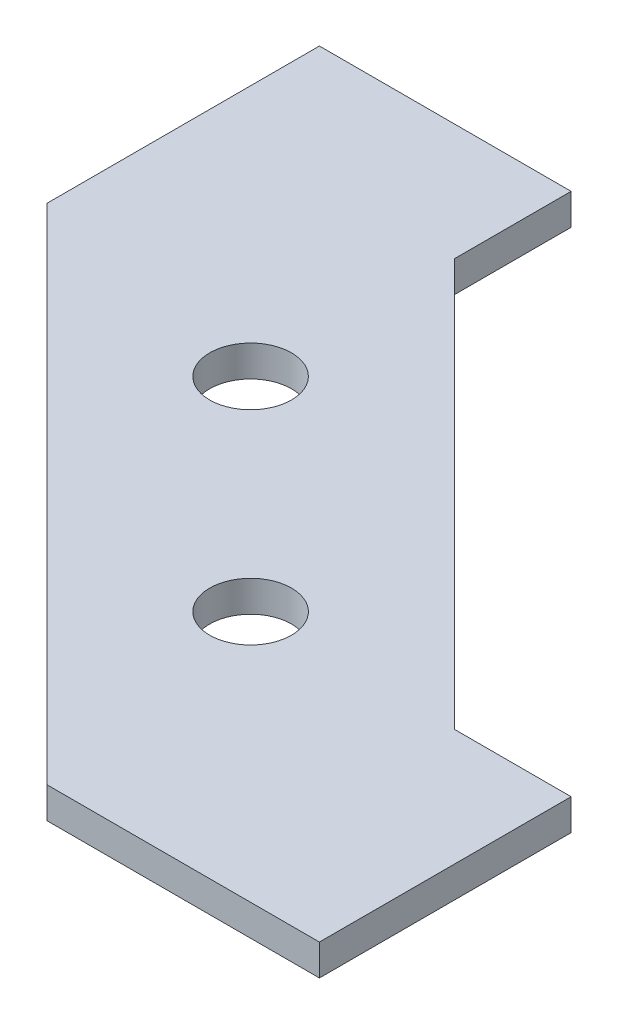
ISO-10303-21;
HEADER;
FILE_DESCRIPTION(('STEP AP214'),'2;1');
FILE_NAME('part.step','',(''),(''),'','','');
FILE_SCHEMA(('AUTOMOTIVE_DESIGN { 1 0 10303 214 1 1 1 1 }'));
ENDSEC;
DATA;
#1=APPLICATION_CONTEXT('core data for automotive mechanical design processes');
#2=APPLICATION_PROTOCOL_DEFINITION('international standard','automotive_design',2000,#1);
#3=PRODUCT_CONTEXT('',#1,'mechanical');
#4=PRODUCT('Part','Part','',(#3));
#5=PRODUCT_RELATED_PRODUCT_CATEGORY('part','',(#4));
#6=PRODUCT_DEFINITION_FORMATION('','',#4);
#7=PRODUCT_DEFINITION_CONTEXT('part definition',#1,'design');
#8=PRODUCT_DEFINITION('design','',#6,#7);
#9=PRODUCT_DEFINITION_SHAPE('','',#8);
#10=(LENGTH_UNIT() NAMED_UNIT(*) SI_UNIT(.MILLI.,.METRE.));
#11=(NAMED_UNIT(*) PLANE_ANGLE_UNIT() SI_UNIT($,.RADIAN.));
#12=(NAMED_UNIT(*) SI_UNIT($,.STERADIAN.) SOLID_ANGLE_UNIT());
#13=UNCERTAINTY_MEASURE_WITH_UNIT(LENGTH_MEASURE(1.E-05),#10,'distance_accuracy_value','');
#14=(GEOMETRIC_REPRESENTATION_CONTEXT(3) GLOBAL_UNCERTAINTY_ASSIGNED_CONTEXT((#13)) GLOBAL_UNIT_ASSIGNED_CONTEXT((#10,
#11,#12)) REPRESENTATION_CONTEXT('',''));
#15=CARTESIAN_POINT('',(0.,0.,0.));
#16=DIRECTION('',(0.,0.,1.));
#17=DIRECTION('',(1.,0.,0.));
#18=AXIS2_PLACEMENT_3D('',#15,#16,#17);
#19=CARTESIAN_POINT('',(54.2444263558534,-4.,13.0814754519512));
#20=DIRECTION('',(1.,0.,0.));
#21=DIRECTION('',(0.,0.,-1.));
#22=AXIS2_PLACEMENT_3D('',#19,#20,#21);
#23=PLANE('',#22);
#24=DIRECTION('',(0.,0.,-1.));
#25=VECTOR('',#24,1.);
#26=CARTESIAN_POINT('',(54.2444263558534,0.,13.0814754519512));
#27=LINE('',#26,#25);
#28=CARTESIAN_POINT('',(54.2444263558533,0.,45.4073772597558));
#29=VERTEX_POINT('',#28);
#30=CARTESIAN_POINT('',(54.2444263558534,0.,13.0814754519512));
#31=VERTEX_POINT('',#30);
#32=EDGE_CURVE('E131',#29,#31,#27,.T.);
#33=ORIENTED_EDGE('',*,*,#32,.F.);
#34=DIRECTION('',(0.,1.,0.));
#35=VECTOR('',#34,1.);
#36=CARTESIAN_POINT('',(54.2444263558533,-4.,45.4073772597558));
#37=LINE('',#36,#35);
#38=CARTESIAN_POINT('',(54.2444263558533,-4.,45.4073772597558));
#39=VERTEX_POINT('',#38);
#40=EDGE_CURVE('E11',#39,#29,#37,.T.);
#41=ORIENTED_EDGE('',*,*,#40,.F.);
#42=DIRECTION('',(0.,0.,-1.));
#43=VECTOR('',#42,1.);
#44=CARTESIAN_POINT('',(54.2444263558534,-4.,13.0814754519512));
#45=LINE('',#44,#43);
#46=CARTESIAN_POINT('',(54.2444263558534,-4.,13.0814754519512));
#47=VERTEX_POINT('',#46);
#48=EDGE_CURVE('E152',#39,#47,#45,.T.);
#49=ORIENTED_EDGE('',*,*,#48,.T.);
#50=DIRECTION('',(0.,1.,0.));
#51=VECTOR('',#50,1.);
#52=CARTESIAN_POINT('',(54.2444263558534,-4.,13.0814754519512));
#53=LINE('',#52,#51);
#54=EDGE_CURVE('E37',#47,#31,#53,.T.);
#55=ORIENTED_EDGE('',*,*,#54,.T.);
#56=EDGE_LOOP('',(#33,#41,#49,#55));
#57=FACE_BOUND('',#56,.T.);
#58=ADVANCED_FACE('F34',(#57),#23,.T.);
#59=CARTESIAN_POINT('',(54.2444263558533,-4.,45.4073772597558));
#60=DIRECTION('',(0.,0.,1.));
#61=DIRECTION('',(1.,0.,0.));
#62=AXIS2_PLACEMENT_3D('',#59,#60,#61);
#63=PLANE('',#62);
#64=DIRECTION('',(1.,0.,0.));
#65=VECTOR('',#64,1.);
#66=CARTESIAN_POINT('',(54.2444263558533,0.,45.4073772597558));
#67=LINE('',#66,#65);
#68=CARTESIAN_POINT('',(19.2444263558533,0.,45.4073772597557));
#69=VERTEX_POINT('',#68);
#70=EDGE_CURVE('E150',#69,#29,#67,.T.);
#71=ORIENTED_EDGE('',*,*,#70,.F.);
#72=DIRECTION('',(0.,1.,0.));
#73=VECTOR('',#72,1.);
#74=CARTESIAN_POINT('',(19.2444263558533,-3.99999999999999,45.4073772597557));
#75=LINE('',#74,#73);
#76=CARTESIAN_POINT('',(19.2444263558533,-3.99999999999999,45.4073772597557));
#77=VERTEX_POINT('',#76);
#78=EDGE_CURVE('E43',#77,#69,#75,.T.);
#79=ORIENTED_EDGE('',*,*,#78,.F.);
#80=DIRECTION('',(1.,0.,0.));
#81=VECTOR('',#80,1.);
#82=CARTESIAN_POINT('',(54.2444263558533,-4.,45.4073772597558));
#83=LINE('',#82,#81);
#84=EDGE_CURVE('E121',#77,#39,#83,.T.);
#85=ORIENTED_EDGE('',*,*,#84,.T.);
#86=ORIENTED_EDGE('',*,*,#40,.T.);
#87=EDGE_LOOP('',(#71,#79,#85,#86));
#88=FACE_BOUND('',#87,.T.);
#89=ADVANCED_FACE('F164',(#88),#63,.T.);
#90=CARTESIAN_POINT('',(-45.4073772597556,-4.00000000000001,-19.2444263558534));
#91=DIRECTION('',(-0.707106781186549,0.,0.707106781186547));
#92=DIRECTION('',(0.707106781186547,0.,0.707106781186549));
#93=AXIS2_PLACEMENT_3D('',#90,#91,#92);
#94=PLANE('',#93);
#95=DIRECTION('',(0.707106781186546,0.,0.707106781186548));
#96=VECTOR('',#95,1.);
#97=CARTESIAN_POINT('',(-45.4073772597556,0.,-19.2444263558534));
#98=LINE('',#97,#96);
#99=CARTESIAN_POINT('',(-45.4073772597556,0.,-19.2444263558534));
#100=VERTEX_POINT('',#99);
#101=EDGE_CURVE('E108',#100,#69,#98,.T.);
#102=ORIENTED_EDGE('',*,*,#101,.F.);
#103=DIRECTION('',(0.,1.,0.));
#104=VECTOR('',#103,1.);
#105=CARTESIAN_POINT('',(-45.4073772597556,-4.00000000000001,-19.2444263558534));
#106=LINE('',#105,#104);
#107=CARTESIAN_POINT('',(-45.4073772597556,-4.00000000000001,-19.2444263558534));
#108=VERTEX_POINT('',#107);
#109=EDGE_CURVE('E103',#108,#100,#106,.T.);
#110=ORIENTED_EDGE('',*,*,#109,.F.);
#111=DIRECTION('',(0.707106781186546,0.,0.707106781186548));
#112=VECTOR('',#111,1.);
#113=CARTESIAN_POINT('',(-45.4073772597556,-4.00000000000001,-19.2444263558534));
#114=LINE('',#113,#112);
#115=EDGE_CURVE('E106',#108,#77,#114,.T.);
#116=ORIENTED_EDGE('',*,*,#115,.T.);
#117=ORIENTED_EDGE('',*,*,#78,.T.);
#118=EDGE_LOOP('',(#102,#110,#116,#117));
#119=FACE_BOUND('',#118,.T.);
#120=ADVANCED_FACE('F105',(#119),#94,.T.);
#121=CARTESIAN_POINT('',(-45.4073772597556,-4.,-54.2444263558534));
#122=DIRECTION('',(-1.,0.,0.));
#123=DIRECTION('',(0.,0.,1.));
#124=AXIS2_PLACEMENT_3D('',#121,#122,#123);
#125=PLANE('',#124);
#126=DIRECTION('',(0.,0.,1.));
#127=VECTOR('',#126,1.);
#128=CARTESIAN_POINT('',(-45.4073772597556,0.,-54.2444263558535));
#129=LINE('',#128,#127);
#130=CARTESIAN_POINT('',(-45.4073772597556,0.,-54.2444263558535));
#131=VERTEX_POINT('',#130);
#132=EDGE_CURVE('E147',#131,#100,#129,.T.);
#133=ORIENTED_EDGE('',*,*,#132,.F.);
#134=DIRECTION('',(0.,1.,0.));
#135=VECTOR('',#134,1.);
#136=CARTESIAN_POINT('',(-45.4073772597556,-4.,-54.2444263558534));
#137=LINE('',#136,#135);
#138=CARTESIAN_POINT('',(-45.4073772597556,-4.,-54.2444263558534));
#139=VERTEX_POINT('',#138);
#140=EDGE_CURVE('E113',#139,#131,#137,.T.);
#141=ORIENTED_EDGE('',*,*,#140,.F.);
#142=DIRECTION('',(0.,0.,1.));
#143=VECTOR('',#142,1.);
#144=CARTESIAN_POINT('',(-45.4073772597556,-4.,-54.2444263558534));
#145=LINE('',#144,#143);
#146=EDGE_CURVE('E119',#139,#108,#145,.T.);
#147=ORIENTED_EDGE('',*,*,#146,.T.);
#148=ORIENTED_EDGE('',*,*,#109,.T.);
#149=EDGE_LOOP('',(#133,#141,#147,#148));
#150=FACE_BOUND('',#149,.T.);
#151=ADVANCED_FACE('F123',(#150),#125,.T.);
#152=CARTESIAN_POINT('',(-13.0814754519511,-4.,-54.2444263558534));
#153=DIRECTION('',(0.,0.,-1.));
#154=DIRECTION('',(-1.,0.,0.));
#155=AXIS2_PLACEMENT_3D('',#152,#153,#154);
#156=PLANE('',#155);
#157=DIRECTION('',(-1.,0.,0.));
#158=VECTOR('',#157,1.);
#159=CARTESIAN_POINT('',(-13.0814754519512,0.,-54.2444263558534));
#160=LINE('',#159,#158);
#161=CARTESIAN_POINT('',(-13.0814754519512,0.,-54.2444263558534));
#162=VERTEX_POINT('',#161);
#163=EDGE_CURVE('E144',#162,#131,#160,.T.);
#164=ORIENTED_EDGE('',*,*,#163,.F.);
#165=DIRECTION('',(0.,1.,0.));
#166=VECTOR('',#165,1.);
#167=CARTESIAN_POINT('',(-13.0814754519511,-4.,-54.2444263558534));
#168=LINE('',#167,#166);
#169=CARTESIAN_POINT('',(-13.0814754519511,-4.,-54.2444263558534));
#170=VERTEX_POINT('',#169);
#171=EDGE_CURVE('E156',#170,#162,#168,.T.);
#172=ORIENTED_EDGE('',*,*,#171,.F.);
#173=DIRECTION('',(-1.,0.,0.));
#174=VECTOR('',#173,1.);
#175=CARTESIAN_POINT('',(-13.0814754519511,-4.,-54.2444263558534));
#176=LINE('',#175,#174);
#177=EDGE_CURVE('E124',#170,#139,#176,.T.);
#178=ORIENTED_EDGE('',*,*,#177,.T.);
#179=ORIENTED_EDGE('',*,*,#140,.T.);
#180=EDGE_LOOP('',(#164,#172,#178,#179));
#181=FACE_BOUND('',#180,.T.);
#182=ADVANCED_FACE('F177',(#181),#156,.T.);
#183=CARTESIAN_POINT('',(-13.0814754519511,-4.00000000000001,-39.2444263558534));
#184=DIRECTION('',(1.,0.,0.));
#185=DIRECTION('',(0.,0.,-1.));
#186=AXIS2_PLACEMENT_3D('',#183,#184,#185);
#187=PLANE('',#186);
#188=DIRECTION('',(0.,0.,-1.));
#189=VECTOR('',#188,1.);
#190=CARTESIAN_POINT('',(-13.0814754519511,0.,-39.2444263558534));
#191=LINE('',#190,#189);
#192=CARTESIAN_POINT('',(-13.0814754519511,0.,-39.2444263558534));
#193=VERTEX_POINT('',#192);
#194=EDGE_CURVE('E141',#193,#162,#191,.T.);
#195=ORIENTED_EDGE('',*,*,#194,.F.);
#196=DIRECTION('',(0.,1.,0.));
#197=VECTOR('',#196,1.);
#198=CARTESIAN_POINT('',(-13.0814754519511,-4.00000000000001,-39.2444263558534));
#199=LINE('',#198,#197);
#200=CARTESIAN_POINT('',(-13.0814754519511,-4.00000000000001,-39.2444263558534));
#201=VERTEX_POINT('',#200);
#202=EDGE_CURVE('E158',#201,#193,#199,.T.);
#203=ORIENTED_EDGE('',*,*,#202,.F.);
#204=DIRECTION('',(0.,0.,-1.));
#205=VECTOR('',#204,1.);
#206=CARTESIAN_POINT('',(-13.0814754519511,-4.00000000000001,-39.2444263558534));
#207=LINE('',#206,#205);
#208=EDGE_CURVE('E126',#201,#170,#207,.T.);
#209=ORIENTED_EDGE('',*,*,#208,.T.);
#210=ORIENTED_EDGE('',*,*,#171,.T.);
#211=EDGE_LOOP('',(#195,#203,#209,#210));
#212=FACE_BOUND('',#211,.T.);
#213=ADVANCED_FACE('F180',(#212),#187,.T.);
#214=CARTESIAN_POINT('',(39.2444263558534,-3.99999999999999,13.0814754519512));
#215=DIRECTION('',(0.707106781186548,0.,-0.707106781186547));
#216=DIRECTION('',(-0.707106781186547,0.,-0.707106781186548));
#217=AXIS2_PLACEMENT_3D('',#214,#215,#216);
#218=PLANE('',#217);
#219=DIRECTION('',(-0.707106781186547,0.,-0.707106781186548));
#220=VECTOR('',#219,1.);
#221=CARTESIAN_POINT('',(39.2444263558534,0.,13.0814754519512));
#222=LINE('',#221,#220);
#223=CARTESIAN_POINT('',(39.2444263558534,0.,13.0814754519512));
#224=VERTEX_POINT('',#223);
#225=EDGE_CURVE('E138',#224,#193,#222,.T.);
#226=ORIENTED_EDGE('',*,*,#225,.F.);
#227=DIRECTION('',(0.,1.,0.));
#228=VECTOR('',#227,1.);
#229=CARTESIAN_POINT('',(39.2444263558534,-3.99999999999999,13.0814754519512));
#230=LINE('',#229,#228);
#231=CARTESIAN_POINT('',(39.2444263558534,-3.99999999999999,13.0814754519512));
#232=VERTEX_POINT('',#231);
#233=EDGE_CURVE('E159',#232,#224,#230,.T.);
#234=ORIENTED_EDGE('',*,*,#233,.F.);
#235=DIRECTION('',(-0.707106781186547,0.,-0.707106781186548));
#236=VECTOR('',#235,1.);
#237=CARTESIAN_POINT('',(39.2444263558534,-3.99999999999999,13.0814754519512));
#238=LINE('',#237,#236);
#239=EDGE_CURVE('E226',#232,#201,#238,.T.);
#240=ORIENTED_EDGE('',*,*,#239,.T.);
#241=ORIENTED_EDGE('',*,*,#202,.T.);
#242=EDGE_LOOP('',(#226,#234,#240,#241));
#243=FACE_BOUND('',#242,.T.);
#244=ADVANCED_FACE('F184',(#243),#218,.T.);
#245=CARTESIAN_POINT('',(39.2444263558534,-3.99999999999999,13.0814754519512));
#246=DIRECTION('',(0.,0.,-1.));
#247=DIRECTION('',(-1.,0.,0.));
#248=AXIS2_PLACEMENT_3D('',#245,#246,#247);
#249=PLANE('',#248);
#250=DIRECTION('',(-1.,0.,0.));
#251=VECTOR('',#250,1.);
#252=CARTESIAN_POINT('',(39.2444263558534,0.,13.0814754519512));
#253=LINE('',#252,#251);
#254=EDGE_CURVE('E134',#31,#224,#253,.T.);
#255=ORIENTED_EDGE('',*,*,#254,.F.);
#256=ORIENTED_EDGE('',*,*,#54,.F.);
#257=DIRECTION('',(-1.,0.,0.));
#258=VECTOR('',#257,1.);
#259=CARTESIAN_POINT('',(39.2444263558534,-3.99999999999999,13.0814754519512));
#260=LINE('',#259,#258);
#261=EDGE_CURVE('E224',#47,#232,#260,.T.);
#262=ORIENTED_EDGE('',*,*,#261,.T.);
#263=ORIENTED_EDGE('',*,*,#233,.T.);
#264=EDGE_LOOP('',(#255,#256,#262,#263));
#265=FACE_BOUND('',#264,.T.);
#266=ADVANCED_FACE('F161',(#265),#249,.T.);
#267=CARTESIAN_POINT('',(0.,-4.,0.));
#268=DIRECTION('',(0.,-1.,0.));
#269=DIRECTION('',(0.,0.,-1.));
#270=AXIS2_PLACEMENT_3D('',#267,#268,#269);
#271=PLANE('',#270);
#272=CARTESIAN_POINT('',(-13.0814754519511,-4.,-13.0814754519512));
#273=DIRECTION('',(0.,1.,0.));
#274=DIRECTION('',(0.,0.,1.));
#275=AXIS2_PLACEMENT_3D('',#272,#273,#274);
#276=CIRCLE('',#275,5.25);
#277=CARTESIAN_POINT('',(-13.0814754519511,-4.,-7.83147545195115));
#278=VERTEX_POINT('',#277);
#279=EDGE_CURVE('E211',#278,#278,#276,.T.);
#280=ORIENTED_EDGE('',*,*,#279,.T.);
#281=EDGE_LOOP('',(#280));
#282=FACE_BOUND('',#281,.T.);
#283=CARTESIAN_POINT('',(13.0814754519512,-4.,13.0814754519511));
#284=DIRECTION('',(0.,1.,0.));
#285=DIRECTION('',(0.,0.,-1.));
#286=AXIS2_PLACEMENT_3D('',#283,#284,#285);
#287=CIRCLE('',#286,5.24999999999997);
#288=CARTESIAN_POINT('',(13.0814754519512,-4.,7.83147545195113));
#289=VERTEX_POINT('',#288);
#290=EDGE_CURVE('E135',#289,#289,#287,.T.);
#291=ORIENTED_EDGE('',*,*,#290,.T.);
#292=EDGE_LOOP('',(#291));
#293=FACE_BOUND('',#292,.T.);
#294=ORIENTED_EDGE('',*,*,#48,.F.);
#295=ORIENTED_EDGE('',*,*,#84,.F.);
#296=ORIENTED_EDGE('',*,*,#115,.F.);
#297=ORIENTED_EDGE('',*,*,#146,.F.);
#298=ORIENTED_EDGE('',*,*,#177,.F.);
#299=ORIENTED_EDGE('',*,*,#208,.F.);
#300=ORIENTED_EDGE('',*,*,#239,.F.);
#301=ORIENTED_EDGE('',*,*,#261,.F.);
#302=EDGE_LOOP('',(#294,#295,#296,#297,#298,#299,#300,#301));
#303=FACE_BOUND('',#302,.T.);
#304=ADVANCED_FACE('F117',(#282,#293,#303),#271,.T.);
#305=CARTESIAN_POINT('',(0.,0.,0.));
#306=DIRECTION('',(0.,-1.,0.));
#307=DIRECTION('',(0.,0.,-1.));
#308=AXIS2_PLACEMENT_3D('',#305,#306,#307);
#309=PLANE('',#308);
#310=CARTESIAN_POINT('',(-13.0814754519511,0.,-13.0814754519512));
#311=DIRECTION('',(0.,1.,0.));
#312=DIRECTION('',(0.,0.,1.));
#313=AXIS2_PLACEMENT_3D('',#310,#311,#312);
#314=CIRCLE('',#313,5.25);
#315=CARTESIAN_POINT('',(-13.0814754519511,0.,-7.83147545195115));
#316=VERTEX_POINT('',#315);
#317=EDGE_CURVE('E214',#316,#316,#314,.T.);
#318=ORIENTED_EDGE('',*,*,#317,.F.);
#319=EDGE_LOOP('',(#318));
#320=FACE_BOUND('',#319,.T.);
#321=CARTESIAN_POINT('',(13.0814754519512,0.,13.0814754519511));
#322=DIRECTION('',(0.,1.,0.));
#323=DIRECTION('',(0.,0.,-1.));
#324=AXIS2_PLACEMENT_3D('',#321,#322,#323);
#325=CIRCLE('',#324,5.24999999999997);
#326=CARTESIAN_POINT('',(13.0814754519512,0.,7.83147545195113));
#327=VERTEX_POINT('',#326);
#328=EDGE_CURVE('E216',#327,#327,#325,.T.);
#329=ORIENTED_EDGE('',*,*,#328,.F.);
#330=EDGE_LOOP('',(#329));
#331=FACE_BOUND('',#330,.T.);
#332=ORIENTED_EDGE('',*,*,#32,.T.);
#333=ORIENTED_EDGE('',*,*,#254,.T.);
#334=ORIENTED_EDGE('',*,*,#225,.T.);
#335=ORIENTED_EDGE('',*,*,#194,.T.);
#336=ORIENTED_EDGE('',*,*,#163,.T.);
#337=ORIENTED_EDGE('',*,*,#132,.T.);
#338=ORIENTED_EDGE('',*,*,#101,.T.);
#339=ORIENTED_EDGE('',*,*,#70,.T.);
#340=EDGE_LOOP('',(#332,#333,#334,#335,#336,#337,#338,#339));
#341=FACE_BOUND('',#340,.T.);
#342=ADVANCED_FACE('F163',(#320,#331,#341),#309,.F.);
#343=CARTESIAN_POINT('',(13.0814754519512,-4.,13.0814754519511));
#344=DIRECTION('',(0.,1.,0.));
#345=DIRECTION('',(0.,0.,1.));
#346=AXIS2_PLACEMENT_3D('',#343,#344,#345);
#347=CYLINDRICAL_SURFACE('',#346,5.24999999999997);
#348=ORIENTED_EDGE('',*,*,#290,.F.);
#349=EDGE_LOOP('',(#348));
#350=FACE_BOUND('',#349,.T.);
#351=ORIENTED_EDGE('',*,*,#328,.T.);
#352=EDGE_LOOP('',(#351));
#353=FACE_BOUND('',#352,.T.);
#354=ADVANCED_FACE('F196',(#350,#353),#347,.F.);
#355=CARTESIAN_POINT('',(-13.0814754519511,-4.,-13.0814754519512));
#356=DIRECTION('',(0.,1.,0.));
#357=DIRECTION('',(0.,0.,1.));
#358=AXIS2_PLACEMENT_3D('',#355,#356,#357);
#359=CYLINDRICAL_SURFACE('',#358,5.25);
#360=ORIENTED_EDGE('',*,*,#279,.F.);
#361=EDGE_LOOP('',(#360));
#362=FACE_BOUND('',#361,.T.);
#363=ORIENTED_EDGE('',*,*,#317,.T.);
#364=EDGE_LOOP('',(#363));
#365=FACE_BOUND('',#364,.T.);
#366=ADVANCED_FACE('F203',(#362,#365),#359,.F.);
#367=CLOSED_SHELL('',(#58,#89,#120,#151,#182,#213,#244,#266,#304,#342,#354,#366));
#368=MANIFOLD_SOLID_BREP('B2',#367);
#369=ADVANCED_BREP_SHAPE_REPRESENTATION('',(#18,#368),#14);
#370=SHAPE_DEFINITION_REPRESENTATION(#9,#369);
ENDSEC;
END-ISO-10303-21;
